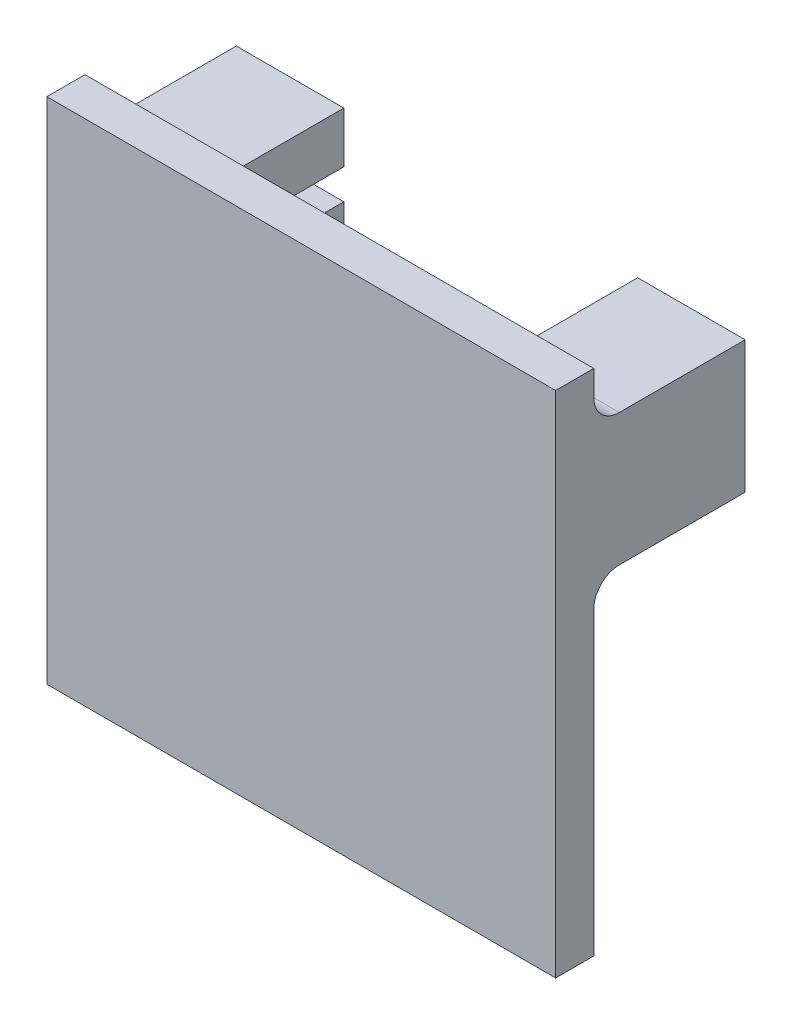
ISO-10303-21;
HEADER;
FILE_DESCRIPTION(('STEP AP214'),'2;1');
FILE_NAME('part.step','',(''),(''),'','','');
FILE_SCHEMA(('AUTOMOTIVE_DESIGN { 1 0 10303 214 1 1 1 1 }'));
ENDSEC;
DATA;
#1=APPLICATION_CONTEXT('core data for automotive mechanical design processes');
#2=APPLICATION_PROTOCOL_DEFINITION('international standard','automotive_design',2000,#1);
#3=PRODUCT_CONTEXT('',#1,'mechanical');
#4=PRODUCT('Part','Part','',(#3));
#5=PRODUCT_RELATED_PRODUCT_CATEGORY('part','',(#4));
#6=PRODUCT_DEFINITION_FORMATION('','',#4);
#7=PRODUCT_DEFINITION_CONTEXT('part definition',#1,'design');
#8=PRODUCT_DEFINITION('design','',#6,#7);
#9=PRODUCT_DEFINITION_SHAPE('','',#8);
#10=(LENGTH_UNIT() NAMED_UNIT(*) SI_UNIT(.MILLI.,.METRE.));
#11=(NAMED_UNIT(*) PLANE_ANGLE_UNIT() SI_UNIT($,.RADIAN.));
#12=(NAMED_UNIT(*) SI_UNIT($,.STERADIAN.) SOLID_ANGLE_UNIT());
#13=UNCERTAINTY_MEASURE_WITH_UNIT(LENGTH_MEASURE(1.E-05),#10,'distance_accuracy_value','');
#14=(GEOMETRIC_REPRESENTATION_CONTEXT(3) GLOBAL_UNCERTAINTY_ASSIGNED_CONTEXT((#13)) GLOBAL_UNIT_ASSIGNED_CONTEXT((#10,
#11,#12)) REPRESENTATION_CONTEXT('',''));
#15=CARTESIAN_POINT('',(0.,0.,0.));
#16=DIRECTION('',(0.,0.,1.));
#17=DIRECTION('',(1.,0.,0.));
#18=AXIS2_PLACEMENT_3D('',#15,#16,#17);
#19=CARTESIAN_POINT('',(0.,0.,0.));
#20=DIRECTION('',(0.,0.,-1.));
#21=DIRECTION('',(-1.,0.,0.));
#22=AXIS2_PLACEMENT_3D('',#19,#20,#21);
#23=PLANE('',#22);
#24=DIRECTION('',(0.,-1.,0.));
#25=VECTOR('',#24,1.);
#26=CARTESIAN_POINT('',(-11.55,21.9321987276376,0.));
#27=LINE('',#26,#25);
#28=CARTESIAN_POINT('',(-11.55,27.9321987276376,0.));
#29=VERTEX_POINT('',#28);
#30=CARTESIAN_POINT('',(-11.55,21.9321987276376,0.));
#31=VERTEX_POINT('',#30);
#32=EDGE_CURVE('E251',#29,#31,#27,.T.);
#33=ORIENTED_EDGE('',*,*,#32,.F.);
#34=DIRECTION('',(1.,0.,0.));
#35=VECTOR('',#34,1.);
#36=CARTESIAN_POINT('',(0.,27.9321987276376,0.));
#37=LINE('',#36,#35);
#38=CARTESIAN_POINT('',(-20.,27.9321987276376,0.));
#39=VERTEX_POINT('',#38);
#40=EDGE_CURVE('E423',#29,#39,#37,.F.);
#41=ORIENTED_EDGE('',*,*,#40,.T.);
#42=DIRECTION('',(0.,-1.,0.));
#43=VECTOR('',#42,1.);
#44=CARTESIAN_POINT('',(-20.,-10.0678012723624,0.));
#45=LINE('',#44,#43);
#46=CARTESIAN_POINT('',(-20.,29.9321987276376,0.));
#47=VERTEX_POINT('',#46);
#48=EDGE_CURVE('E360',#47,#39,#45,.T.);
#49=ORIENTED_EDGE('',*,*,#48,.F.);
#50=DIRECTION('',(-1.,0.,0.));
#51=VECTOR('',#50,1.);
#52=CARTESIAN_POINT('',(-20.,29.9321987276376,0.));
#53=LINE('',#52,#51);
#54=CARTESIAN_POINT('',(20.,29.9321987276376,0.));
#55=VERTEX_POINT('',#54);
#56=EDGE_CURVE('E350',#55,#47,#53,.T.);
#57=ORIENTED_EDGE('',*,*,#56,.F.);
#58=DIRECTION('',(0.,1.,0.));
#59=VECTOR('',#58,1.);
#60=CARTESIAN_POINT('',(20.,-10.0678012723624,0.));
#61=LINE('',#60,#59);
#62=CARTESIAN_POINT('',(20.,27.9321987276376,0.));
#63=VERTEX_POINT('',#62);
#64=EDGE_CURVE('E367',#63,#55,#61,.T.);
#65=ORIENTED_EDGE('',*,*,#64,.F.);
#66=DIRECTION('',(1.,0.,0.));
#67=VECTOR('',#66,1.);
#68=CARTESIAN_POINT('',(0.,27.9321987276376,0.));
#69=LINE('',#68,#67);
#70=CARTESIAN_POINT('',(11.55,27.9321987276376,0.));
#71=VERTEX_POINT('',#70);
#72=EDGE_CURVE('E230',#63,#71,#69,.F.);
#73=ORIENTED_EDGE('',*,*,#72,.T.);
#74=DIRECTION('',(0.,1.,0.));
#75=VECTOR('',#74,1.);
#76=CARTESIAN_POINT('',(11.55,21.9321987276376,0.));
#77=LINE('',#76,#75);
#78=CARTESIAN_POINT('',(11.55,21.9321987276376,0.));
#79=VERTEX_POINT('',#78);
#80=EDGE_CURVE('E218',#79,#71,#77,.T.);
#81=ORIENTED_EDGE('',*,*,#80,.F.);
#82=DIRECTION('',(-1.,0.,0.));
#83=VECTOR('',#82,1.);
#84=CARTESIAN_POINT('',(11.55,21.9321987276376,0.));
#85=LINE('',#84,#83);
#86=CARTESIAN_POINT('',(16.45,21.9321987276376,0.));
#87=VERTEX_POINT('',#86);
#88=EDGE_CURVE('E205',#87,#79,#85,.T.);
#89=ORIENTED_EDGE('',*,*,#88,.F.);
#90=DIRECTION('',(0.,1.,0.));
#91=VECTOR('',#90,1.);
#92=CARTESIAN_POINT('',(16.45,19.5521987276376,0.));
#93=LINE('',#92,#91);
#94=CARTESIAN_POINT('',(16.45,19.5521987276376,0.));
#95=VERTEX_POINT('',#94);
#96=EDGE_CURVE('E217',#95,#87,#93,.T.);
#97=ORIENTED_EDGE('',*,*,#96,.F.);
#98=DIRECTION('',(1.,0.,0.));
#99=VECTOR('',#98,1.);
#100=CARTESIAN_POINT('',(11.55,19.5521987276376,0.));
#101=LINE('',#100,#99);
#102=CARTESIAN_POINT('',(11.55,19.5521987276376,0.));
#103=VERTEX_POINT('',#102);
#104=EDGE_CURVE('E245',#103,#95,#101,.T.);
#105=ORIENTED_EDGE('',*,*,#104,.F.);
#106=DIRECTION('',(0.,1.,0.));
#107=VECTOR('',#106,1.);
#108=CARTESIAN_POINT('',(11.55,15.5521987276376,0.));
#109=LINE('',#108,#107);
#110=CARTESIAN_POINT('',(11.55,13.5521987276376,0.));
#111=VERTEX_POINT('',#110);
#112=EDGE_CURVE('E248',#111,#103,#109,.T.);
#113=ORIENTED_EDGE('',*,*,#112,.F.);
#114=DIRECTION('',(-1.,0.,0.));
#115=VECTOR('',#114,1.);
#116=CARTESIAN_POINT('',(0.,13.5521987276376,0.));
#117=LINE('',#116,#115);
#118=CARTESIAN_POINT('',(20.,13.5521987276376,0.));
#119=VERTEX_POINT('',#118);
#120=EDGE_CURVE('E393',#111,#119,#117,.F.);
#121=ORIENTED_EDGE('',*,*,#120,.T.);
#122=CARTESIAN_POINT('',(20.,-10.0678012723624,0.));
#123=VERTEX_POINT('',#122);
#124=EDGE_CURVE('E368',#123,#119,#61,.T.);
#125=ORIENTED_EDGE('',*,*,#124,.F.);
#126=DIRECTION('',(1.,0.,0.));
#127=VECTOR('',#126,1.);
#128=CARTESIAN_POINT('',(-20.,-10.0678012723624,0.));
#129=LINE('',#128,#127);
#130=CARTESIAN_POINT('',(-20.,-10.0678012723624,0.));
#131=VERTEX_POINT('',#130);
#132=EDGE_CURVE('E364',#131,#123,#129,.T.);
#133=ORIENTED_EDGE('',*,*,#132,.F.);
#134=CARTESIAN_POINT('',(-20.,13.5521987276376,0.));
#135=VERTEX_POINT('',#134);
#136=EDGE_CURVE('E345',#135,#131,#45,.T.);
#137=ORIENTED_EDGE('',*,*,#136,.F.);
#138=DIRECTION('',(-1.,0.,0.));
#139=VECTOR('',#138,1.);
#140=CARTESIAN_POINT('',(0.,13.5521987276376,0.));
#141=LINE('',#140,#139);
#142=CARTESIAN_POINT('',(-11.55,13.5521987276376,0.));
#143=VERTEX_POINT('',#142);
#144=EDGE_CURVE('E419',#135,#143,#141,.F.);
#145=ORIENTED_EDGE('',*,*,#144,.T.);
#146=DIRECTION('',(0.,-1.,0.));
#147=VECTOR('',#146,1.);
#148=CARTESIAN_POINT('',(-11.55,15.5521987276376,0.));
#149=LINE('',#148,#147);
#150=CARTESIAN_POINT('',(-11.55,19.5521987276376,0.));
#151=VERTEX_POINT('',#150);
#152=EDGE_CURVE('E276',#151,#143,#149,.T.);
#153=ORIENTED_EDGE('',*,*,#152,.F.);
#154=DIRECTION('',(1.,0.,0.));
#155=VECTOR('',#154,1.);
#156=CARTESIAN_POINT('',(-11.55,19.5521987276376,0.));
#157=LINE('',#156,#155);
#158=CARTESIAN_POINT('',(-16.45,19.5521987276376,0.));
#159=VERTEX_POINT('',#158);
#160=EDGE_CURVE('E309',#159,#151,#157,.T.);
#161=ORIENTED_EDGE('',*,*,#160,.F.);
#162=DIRECTION('',(0.,-1.,0.));
#163=VECTOR('',#162,1.);
#164=CARTESIAN_POINT('',(-16.45,19.5521987276376,0.));
#165=LINE('',#164,#163);
#166=CARTESIAN_POINT('',(-16.45,21.9321987276376,0.));
#167=VERTEX_POINT('',#166);
#168=EDGE_CURVE('E305',#167,#159,#165,.T.);
#169=ORIENTED_EDGE('',*,*,#168,.F.);
#170=DIRECTION('',(-1.,0.,0.));
#171=VECTOR('',#170,1.);
#172=CARTESIAN_POINT('',(-11.55,21.9321987276376,0.));
#173=LINE('',#172,#171);
#174=EDGE_CURVE('E301',#31,#167,#173,.T.);
#175=ORIENTED_EDGE('',*,*,#174,.F.);
#176=EDGE_LOOP('',(#33,#41,#49,#57,#65,#73,#81,#89,#97,#105,#113,#121,#125,#133,#137,#145,#153,
#161,#169,#175));
#177=FACE_BOUND('',#176,.T.);
#178=ADVANCED_FACE('F43',(#177),#23,.T.);
#179=CARTESIAN_POINT('',(-20.,-10.0678012723624,3.));
#180=DIRECTION('',(1.,0.,0.));
#181=DIRECTION('',(0.,0.,-1.));
#182=AXIS2_PLACEMENT_3D('',#179,#180,#181);
#183=PLANE('',#182);
#184=ORIENTED_EDGE('',*,*,#48,.T.);
#185=CARTESIAN_POINT('',(-20.,27.9321987276376,-2.));
#186=DIRECTION('',(1.,0.,0.));
#187=DIRECTION('',(0.,0.,-1.));
#188=AXIS2_PLACEMENT_3D('',#185,#186,#187);
#189=CIRCLE('',#188,2.);
#190=CARTESIAN_POINT('',(-20.,25.9321987276376,-2.));
#191=VERTEX_POINT('',#190);
#192=EDGE_CURVE('E433',#39,#191,#189,.T.);
#193=ORIENTED_EDGE('',*,*,#192,.T.);
#194=DIRECTION('',(0.,0.,1.));
#195=VECTOR('',#194,1.);
#196=CARTESIAN_POINT('',(-20.,25.9321987276376,-11.9));
#197=LINE('',#196,#195);
#198=CARTESIAN_POINT('',(-20.,25.9321987276376,-11.9));
#199=VERTEX_POINT('',#198);
#200=EDGE_CURVE('E341',#199,#191,#197,.T.);
#201=ORIENTED_EDGE('',*,*,#200,.F.);
#202=DIRECTION('',(0.,1.,0.));
#203=VECTOR('',#202,1.);
#204=CARTESIAN_POINT('',(-20.,15.5521987276376,-11.9));
#205=LINE('',#204,#203);
#206=CARTESIAN_POINT('',(-20.,15.5521987276376,-11.9));
#207=VERTEX_POINT('',#206);
#208=EDGE_CURVE('E271',#207,#199,#205,.T.);
#209=ORIENTED_EDGE('',*,*,#208,.F.);
#210=DIRECTION('',(0.,0.,1.));
#211=VECTOR('',#210,1.);
#212=CARTESIAN_POINT('',(-20.,15.5521987276376,-11.9));
#213=LINE('',#212,#211);
#214=CARTESIAN_POINT('',(-20.,15.5521987276376,-2.));
#215=VERTEX_POINT('',#214);
#216=EDGE_CURVE('E297',#207,#215,#213,.T.);
#217=ORIENTED_EDGE('',*,*,#216,.T.);
#218=CARTESIAN_POINT('',(-20.,13.5521987276376,-2.));
#219=DIRECTION('',(1.,0.,0.));
#220=DIRECTION('',(0.,0.,-1.));
#221=AXIS2_PLACEMENT_3D('',#218,#219,#220);
#222=CIRCLE('',#221,2.);
#223=EDGE_CURVE('E52',#215,#135,#222,.T.);
#224=ORIENTED_EDGE('',*,*,#223,.T.);
#225=ORIENTED_EDGE('',*,*,#136,.T.);
#226=DIRECTION('',(0.,0.,-1.));
#227=VECTOR('',#226,1.);
#228=CARTESIAN_POINT('',(-20.,-10.0678012723624,3.));
#229=LINE('',#228,#227);
#230=CARTESIAN_POINT('',(-20.,-10.0678012723624,3.));
#231=VERTEX_POINT('',#230);
#232=EDGE_CURVE('E385',#231,#131,#229,.T.);
#233=ORIENTED_EDGE('',*,*,#232,.F.);
#234=DIRECTION('',(0.,-1.,0.));
#235=VECTOR('',#234,1.);
#236=CARTESIAN_POINT('',(-20.,-10.0678012723624,3.));
#237=LINE('',#236,#235);
#238=CARTESIAN_POINT('',(-20.,29.9321987276376,3.));
#239=VERTEX_POINT('',#238);
#240=EDGE_CURVE('E346',#239,#231,#237,.T.);
#241=ORIENTED_EDGE('',*,*,#240,.F.);
#242=DIRECTION('',(0.,0.,-1.));
#243=VECTOR('',#242,1.);
#244=CARTESIAN_POINT('',(-20.,29.9321987276376,3.));
#245=LINE('',#244,#243);
#246=EDGE_CURVE('E359',#239,#47,#245,.T.);
#247=ORIENTED_EDGE('',*,*,#246,.T.);
#248=EDGE_LOOP('',(#184,#193,#201,#209,#217,#224,#225,#233,#241,#247));
#249=FACE_BOUND('',#248,.T.);
#250=ADVANCED_FACE('F438',(#249),#183,.F.);
#251=CARTESIAN_POINT('',(-20.,-10.0678012723624,3.));
#252=DIRECTION('',(0.,1.,0.));
#253=DIRECTION('',(0.,0.,1.));
#254=AXIS2_PLACEMENT_3D('',#251,#252,#253);
#255=PLANE('',#254);
#256=ORIENTED_EDGE('',*,*,#132,.T.);
#257=DIRECTION('',(0.,0.,-1.));
#258=VECTOR('',#257,1.);
#259=CARTESIAN_POINT('',(20.,-10.0678012723624,3.));
#260=LINE('',#259,#258);
#261=CARTESIAN_POINT('',(20.,-10.0678012723624,3.));
#262=VERTEX_POINT('',#261);
#263=EDGE_CURVE('E381',#262,#123,#260,.T.);
#264=ORIENTED_EDGE('',*,*,#263,.F.);
#265=DIRECTION('',(1.,0.,0.));
#266=VECTOR('',#265,1.);
#267=CARTESIAN_POINT('',(-20.,-10.0678012723624,3.));
#268=LINE('',#267,#266);
#269=EDGE_CURVE('E349',#231,#262,#268,.T.);
#270=ORIENTED_EDGE('',*,*,#269,.F.);
#271=ORIENTED_EDGE('',*,*,#232,.T.);
#272=EDGE_LOOP('',(#256,#264,#270,#271));
#273=FACE_BOUND('',#272,.T.);
#274=ADVANCED_FACE('F532',(#273),#255,.F.);
#275=CARTESIAN_POINT('',(20.,-10.0678012723624,3.));
#276=DIRECTION('',(-1.,0.,0.));
#277=DIRECTION('',(0.,0.,1.));
#278=AXIS2_PLACEMENT_3D('',#275,#276,#277);
#279=PLANE('',#278);
#280=DIRECTION('',(0.,0.,-1.));
#281=VECTOR('',#280,1.);
#282=CARTESIAN_POINT('',(20.,29.9321987276376,3.));
#283=LINE('',#282,#281);
#284=CARTESIAN_POINT('',(20.,29.9321987276376,3.));
#285=VERTEX_POINT('',#284);
#286=EDGE_CURVE('E377',#285,#55,#283,.T.);
#287=ORIENTED_EDGE('',*,*,#286,.F.);
#288=DIRECTION('',(0.,1.,0.));
#289=VECTOR('',#288,1.);
#290=CARTESIAN_POINT('',(20.,-10.0678012723624,3.));
#291=LINE('',#290,#289);
#292=EDGE_CURVE('E353',#262,#285,#291,.T.);
#293=ORIENTED_EDGE('',*,*,#292,.F.);
#294=ORIENTED_EDGE('',*,*,#263,.T.);
#295=ORIENTED_EDGE('',*,*,#124,.T.);
#296=CARTESIAN_POINT('',(20.,13.5521987276376,-2.));
#297=DIRECTION('',(-1.,0.,0.));
#298=DIRECTION('',(0.,0.,1.));
#299=AXIS2_PLACEMENT_3D('',#296,#297,#298);
#300=CIRCLE('',#299,2.);
#301=CARTESIAN_POINT('',(20.,15.5521987276376,-2.));
#302=VERTEX_POINT('',#301);
#303=EDGE_CURVE('E412',#119,#302,#300,.T.);
#304=ORIENTED_EDGE('',*,*,#303,.T.);
#305=DIRECTION('',(0.,0.,1.));
#306=VECTOR('',#305,1.);
#307=CARTESIAN_POINT('',(20.,15.5521987276376,-11.9));
#308=LINE('',#307,#306);
#309=CARTESIAN_POINT('',(20.,15.5521987276376,-11.9));
#310=VERTEX_POINT('',#309);
#311=EDGE_CURVE('E240',#310,#302,#308,.T.);
#312=ORIENTED_EDGE('',*,*,#311,.F.);
#313=DIRECTION('',(0.,-1.,0.));
#314=VECTOR('',#313,1.);
#315=CARTESIAN_POINT('',(20.,15.5521987276376,-11.9));
#316=LINE('',#315,#314);
#317=CARTESIAN_POINT('',(20.,25.9321987276376,-11.9));
#318=VERTEX_POINT('',#317);
#319=EDGE_CURVE('E252',#318,#310,#316,.T.);
#320=ORIENTED_EDGE('',*,*,#319,.F.);
#321=DIRECTION('',(0.,0.,1.));
#322=VECTOR('',#321,1.);
#323=CARTESIAN_POINT('',(20.,25.9321987276376,-11.9));
#324=LINE('',#323,#322);
#325=CARTESIAN_POINT('',(20.,25.9321987276376,-2.));
#326=VERTEX_POINT('',#325);
#327=EDGE_CURVE('E495',#318,#326,#324,.T.);
#328=ORIENTED_EDGE('',*,*,#327,.T.);
#329=CARTESIAN_POINT('',(20.,27.9321987276376,-2.));
#330=DIRECTION('',(-1.,0.,0.));
#331=DIRECTION('',(0.,0.,1.));
#332=AXIS2_PLACEMENT_3D('',#329,#330,#331);
#333=CIRCLE('',#332,2.);
#334=EDGE_CURVE('E402',#326,#63,#333,.T.);
#335=ORIENTED_EDGE('',*,*,#334,.T.);
#336=ORIENTED_EDGE('',*,*,#64,.T.);
#337=EDGE_LOOP('',(#287,#293,#294,#295,#304,#312,#320,#328,#335,#336));
#338=FACE_BOUND('',#337,.T.);
#339=ADVANCED_FACE('F527',(#338),#279,.F.);
#340=CARTESIAN_POINT('',(-20.,29.9321987276376,3.));
#341=DIRECTION('',(0.,-1.,0.));
#342=DIRECTION('',(0.,0.,-1.));
#343=AXIS2_PLACEMENT_3D('',#340,#341,#342);
#344=PLANE('',#343);
#345=ORIENTED_EDGE('',*,*,#56,.T.);
#346=ORIENTED_EDGE('',*,*,#246,.F.);
#347=DIRECTION('',(-1.,0.,0.));
#348=VECTOR('',#347,1.);
#349=CARTESIAN_POINT('',(-20.,29.9321987276376,3.));
#350=LINE('',#349,#348);
#351=EDGE_CURVE('E356',#285,#239,#350,.T.);
#352=ORIENTED_EDGE('',*,*,#351,.F.);
#353=ORIENTED_EDGE('',*,*,#286,.T.);
#354=EDGE_LOOP('',(#345,#346,#352,#353));
#355=FACE_BOUND('',#354,.T.);
#356=ADVANCED_FACE('F481',(#355),#344,.F.);
#357=CARTESIAN_POINT('',(0.,0.,3.));
#358=DIRECTION('',(0.,0.,-1.));
#359=DIRECTION('',(-1.,0.,0.));
#360=AXIS2_PLACEMENT_3D('',#357,#358,#359);
#361=PLANE('',#360);
#362=ORIENTED_EDGE('',*,*,#240,.T.);
#363=ORIENTED_EDGE('',*,*,#269,.T.);
#364=ORIENTED_EDGE('',*,*,#292,.T.);
#365=ORIENTED_EDGE('',*,*,#351,.T.);
#366=EDGE_LOOP('',(#362,#363,#364,#365));
#367=FACE_BOUND('',#366,.T.);
#368=ADVANCED_FACE('F534',(#367),#361,.F.);
#369=CARTESIAN_POINT('',(-20.,25.9321987276376,-11.9));
#370=DIRECTION('',(0.,-1.,0.));
#371=DIRECTION('',(1.,0.,0.));
#372=AXIS2_PLACEMENT_3D('',#369,#370,#371);
#373=PLANE('',#372);
#374=ORIENTED_EDGE('',*,*,#200,.T.);
#375=DIRECTION('',(1.,0.,0.));
#376=VECTOR('',#375,1.);
#377=CARTESIAN_POINT('',(-20.,25.9321987276376,-2.));
#378=LINE('',#377,#376);
#379=CARTESIAN_POINT('',(-11.55,25.9321987276376,-2.));
#380=VERTEX_POINT('',#379);
#381=EDGE_CURVE('E415',#191,#380,#378,.T.);
#382=ORIENTED_EDGE('',*,*,#381,.T.);
#383=DIRECTION('',(0.,0.,1.));
#384=VECTOR('',#383,1.);
#385=CARTESIAN_POINT('',(-11.55,25.9321987276376,-11.9));
#386=LINE('',#385,#384);
#387=CARTESIAN_POINT('',(-11.55,25.9321987276376,-11.9));
#388=VERTEX_POINT('',#387);
#389=EDGE_CURVE('E337',#388,#380,#386,.T.);
#390=ORIENTED_EDGE('',*,*,#389,.F.);
#391=DIRECTION('',(1.,0.,0.));
#392=VECTOR('',#391,1.);
#393=CARTESIAN_POINT('',(-20.,25.9321987276376,-11.9));
#394=LINE('',#393,#392);
#395=EDGE_CURVE('E275',#199,#388,#394,.T.);
#396=ORIENTED_EDGE('',*,*,#395,.F.);
#397=EDGE_LOOP('',(#374,#382,#390,#396));
#398=FACE_BOUND('',#397,.T.);
#399=ADVANCED_FACE('F536',(#398),#373,.F.);
#400=CARTESIAN_POINT('',(-11.55,21.9321987276376,-11.9));
#401=DIRECTION('',(-1.,0.,0.));
#402=DIRECTION('',(0.,0.,1.));
#403=AXIS2_PLACEMENT_3D('',#400,#401,#402);
#404=PLANE('',#403);
#405=ORIENTED_EDGE('',*,*,#32,.T.);
#406=DIRECTION('',(0.,0.,1.));
#407=VECTOR('',#406,1.);
#408=CARTESIAN_POINT('',(-11.55,21.9321987276376,-11.9));
#409=LINE('',#408,#407);
#410=CARTESIAN_POINT('',(-11.55,21.9321987276376,-11.9));
#411=VERTEX_POINT('',#410);
#412=EDGE_CURVE('E333',#411,#31,#409,.T.);
#413=ORIENTED_EDGE('',*,*,#412,.F.);
#414=DIRECTION('',(0.,-1.,0.));
#415=VECTOR('',#414,1.);
#416=CARTESIAN_POINT('',(-11.55,21.9321987276376,-11.9));
#417=LINE('',#416,#415);
#418=EDGE_CURVE('E279',#388,#411,#417,.T.);
#419=ORIENTED_EDGE('',*,*,#418,.F.);
#420=ORIENTED_EDGE('',*,*,#389,.T.);
#421=CARTESIAN_POINT('',(-11.55,27.9321987276376,-2.));
#422=DIRECTION('',(-1.,0.,0.));
#423=DIRECTION('',(0.,0.,1.));
#424=AXIS2_PLACEMENT_3D('',#421,#422,#423);
#425=CIRCLE('',#424,2.);
#426=EDGE_CURVE('E429',#380,#29,#425,.T.);
#427=ORIENTED_EDGE('',*,*,#426,.T.);
#428=EDGE_LOOP('',(#405,#413,#419,#420,#427));
#429=FACE_BOUND('',#428,.T.);
#430=ADVANCED_FACE('F466',(#429),#404,.F.);
#431=CARTESIAN_POINT('',(-11.55,21.9321987276376,-11.9));
#432=DIRECTION('',(0.,1.,0.));
#433=DIRECTION('',(0.,0.,1.));
#434=AXIS2_PLACEMENT_3D('',#431,#432,#433);
#435=PLANE('',#434);
#436=ORIENTED_EDGE('',*,*,#174,.T.);
#437=DIRECTION('',(0.,0.,1.));
#438=VECTOR('',#437,1.);
#439=CARTESIAN_POINT('',(-16.45,21.9321987276376,-11.9));
#440=LINE('',#439,#438);
#441=CARTESIAN_POINT('',(-16.45,21.9321987276376,-11.9));
#442=VERTEX_POINT('',#441);
#443=EDGE_CURVE('E329',#442,#167,#440,.T.);
#444=ORIENTED_EDGE('',*,*,#443,.F.);
#445=DIRECTION('',(-1.,0.,0.));
#446=VECTOR('',#445,1.);
#447=CARTESIAN_POINT('',(-11.55,21.9321987276376,-11.9));
#448=LINE('',#447,#446);
#449=EDGE_CURVE('E282',#411,#442,#448,.T.);
#450=ORIENTED_EDGE('',*,*,#449,.F.);
#451=ORIENTED_EDGE('',*,*,#412,.T.);
#452=EDGE_LOOP('',(#436,#444,#450,#451));
#453=FACE_BOUND('',#452,.T.);
#454=ADVANCED_FACE('F463',(#453),#435,.F.);
#455=CARTESIAN_POINT('',(-16.45,19.5521987276376,-11.9));
#456=DIRECTION('',(-1.,0.,0.));
#457=DIRECTION('',(0.,0.,1.));
#458=AXIS2_PLACEMENT_3D('',#455,#456,#457);
#459=PLANE('',#458);
#460=ORIENTED_EDGE('',*,*,#168,.T.);
#461=DIRECTION('',(0.,0.,1.));
#462=VECTOR('',#461,1.);
#463=CARTESIAN_POINT('',(-16.45,19.5521987276376,-11.9));
#464=LINE('',#463,#462);
#465=CARTESIAN_POINT('',(-16.45,19.5521987276376,-11.9));
#466=VERTEX_POINT('',#465);
#467=EDGE_CURVE('E325',#466,#159,#464,.T.);
#468=ORIENTED_EDGE('',*,*,#467,.F.);
#469=DIRECTION('',(0.,-1.,0.));
#470=VECTOR('',#469,1.);
#471=CARTESIAN_POINT('',(-16.45,19.5521987276376,-11.9));
#472=LINE('',#471,#470);
#473=EDGE_CURVE('E285',#442,#466,#472,.T.);
#474=ORIENTED_EDGE('',*,*,#473,.F.);
#475=ORIENTED_EDGE('',*,*,#443,.T.);
#476=EDGE_LOOP('',(#460,#468,#474,#475));
#477=FACE_BOUND('',#476,.T.);
#478=ADVANCED_FACE('F459',(#477),#459,.F.);
#479=CARTESIAN_POINT('',(-11.55,19.5521987276376,-11.9));
#480=DIRECTION('',(0.,-1.,0.));
#481=DIRECTION('',(0.,0.,-1.));
#482=AXIS2_PLACEMENT_3D('',#479,#480,#481);
#483=PLANE('',#482);
#484=ORIENTED_EDGE('',*,*,#160,.T.);
#485=DIRECTION('',(0.,0.,1.));
#486=VECTOR('',#485,1.);
#487=CARTESIAN_POINT('',(-11.55,19.5521987276376,-11.9));
#488=LINE('',#487,#486);
#489=CARTESIAN_POINT('',(-11.55,19.5521987276376,-11.9));
#490=VERTEX_POINT('',#489);
#491=EDGE_CURVE('E321',#490,#151,#488,.T.);
#492=ORIENTED_EDGE('',*,*,#491,.F.);
#493=DIRECTION('',(1.,0.,0.));
#494=VECTOR('',#493,1.);
#495=CARTESIAN_POINT('',(-11.55,19.5521987276376,-11.9));
#496=LINE('',#495,#494);
#497=EDGE_CURVE('E288',#466,#490,#496,.T.);
#498=ORIENTED_EDGE('',*,*,#497,.F.);
#499=ORIENTED_EDGE('',*,*,#467,.T.);
#500=EDGE_LOOP('',(#484,#492,#498,#499));
#501=FACE_BOUND('',#500,.T.);
#502=ADVANCED_FACE('F457',(#501),#483,.F.);
#503=CARTESIAN_POINT('',(-11.55,15.5521987276376,-11.9));
#504=DIRECTION('',(-1.,0.,0.));
#505=DIRECTION('',(0.,0.,1.));
#506=AXIS2_PLACEMENT_3D('',#503,#504,#505);
#507=PLANE('',#506);
#508=ORIENTED_EDGE('',*,*,#152,.T.);
#509=CARTESIAN_POINT('',(-11.55,13.5521987276376,-2.));
#510=DIRECTION('',(-1.,0.,0.));
#511=DIRECTION('',(0.,0.,1.));
#512=AXIS2_PLACEMENT_3D('',#509,#510,#511);
#513=CIRCLE('',#512,2.);
#514=CARTESIAN_POINT('',(-11.55,15.5521987276376,-2.));
#515=VERTEX_POINT('',#514);
#516=EDGE_CURVE('E11',#143,#515,#513,.T.);
#517=ORIENTED_EDGE('',*,*,#516,.T.);
#518=DIRECTION('',(0.,0.,1.));
#519=VECTOR('',#518,1.);
#520=CARTESIAN_POINT('',(-11.55,15.5521987276376,-11.9));
#521=LINE('',#520,#519);
#522=CARTESIAN_POINT('',(-11.55,15.5521987276376,-11.9));
#523=VERTEX_POINT('',#522);
#524=EDGE_CURVE('E318',#523,#515,#521,.T.);
#525=ORIENTED_EDGE('',*,*,#524,.F.);
#526=DIRECTION('',(0.,-1.,0.));
#527=VECTOR('',#526,1.);
#528=CARTESIAN_POINT('',(-11.55,15.5521987276376,-11.9));
#529=LINE('',#528,#527);
#530=EDGE_CURVE('E291',#490,#523,#529,.T.);
#531=ORIENTED_EDGE('',*,*,#530,.F.);
#532=ORIENTED_EDGE('',*,*,#491,.T.);
#533=EDGE_LOOP('',(#508,#517,#525,#531,#532));
#534=FACE_BOUND('',#533,.T.);
#535=ADVANCED_FACE('F449',(#534),#507,.F.);
#536=CARTESIAN_POINT('',(-20.,15.5521987276376,-11.9));
#537=DIRECTION('',(0.,1.,0.));
#538=DIRECTION('',(0.,0.,1.));
#539=AXIS2_PLACEMENT_3D('',#536,#537,#538);
#540=PLANE('',#539);
#541=ORIENTED_EDGE('',*,*,#524,.T.);
#542=DIRECTION('',(-1.,0.,0.));
#543=VECTOR('',#542,1.);
#544=CARTESIAN_POINT('',(-20.,15.5521987276376,-2.));
#545=LINE('',#544,#543);
#546=EDGE_CURVE('E426',#515,#215,#545,.T.);
#547=ORIENTED_EDGE('',*,*,#546,.T.);
#548=ORIENTED_EDGE('',*,*,#216,.F.);
#549=DIRECTION('',(-1.,0.,0.));
#550=VECTOR('',#549,1.);
#551=CARTESIAN_POINT('',(-20.,15.5521987276376,-11.9));
#552=LINE('',#551,#550);
#553=EDGE_CURVE('E294',#523,#207,#552,.T.);
#554=ORIENTED_EDGE('',*,*,#553,.F.);
#555=EDGE_LOOP('',(#541,#547,#548,#554));
#556=FACE_BOUND('',#555,.T.);
#557=ADVANCED_FACE('F446',(#556),#540,.F.);
#558=CARTESIAN_POINT('',(0.,0.,-11.9));
#559=DIRECTION('',(0.,0.,-1.));
#560=DIRECTION('',(-1.,0.,0.));
#561=AXIS2_PLACEMENT_3D('',#558,#559,#560);
#562=PLANE('',#561);
#563=ORIENTED_EDGE('',*,*,#208,.T.);
#564=ORIENTED_EDGE('',*,*,#395,.T.);
#565=ORIENTED_EDGE('',*,*,#418,.T.);
#566=ORIENTED_EDGE('',*,*,#449,.T.);
#567=ORIENTED_EDGE('',*,*,#473,.T.);
#568=ORIENTED_EDGE('',*,*,#497,.T.);
#569=ORIENTED_EDGE('',*,*,#530,.T.);
#570=ORIENTED_EDGE('',*,*,#553,.T.);
#571=EDGE_LOOP('',(#563,#564,#565,#566,#567,#568,#569,#570));
#572=FACE_BOUND('',#571,.T.);
#573=ADVANCED_FACE('F452',(#572),#562,.T.);
#574=CARTESIAN_POINT('',(20.,15.5521987276376,-11.9));
#575=DIRECTION('',(0.,1.,0.));
#576=DIRECTION('',(0.,0.,1.));
#577=AXIS2_PLACEMENT_3D('',#574,#575,#576);
#578=PLANE('',#577);
#579=ORIENTED_EDGE('',*,*,#311,.T.);
#580=DIRECTION('',(-1.,0.,0.));
#581=VECTOR('',#580,1.);
#582=CARTESIAN_POINT('',(20.,15.5521987276376,-2.));
#583=LINE('',#582,#581);
#584=CARTESIAN_POINT('',(11.55,15.5521987276376,-2.));
#585=VERTEX_POINT('',#584);
#586=EDGE_CURVE('E398',#302,#585,#583,.T.);
#587=ORIENTED_EDGE('',*,*,#586,.T.);
#588=DIRECTION('',(0.,0.,1.));
#589=VECTOR('',#588,1.);
#590=CARTESIAN_POINT('',(11.55,15.5521987276376,-11.9));
#591=LINE('',#590,#589);
#592=CARTESIAN_POINT('',(11.55,15.5521987276376,-11.9));
#593=VERTEX_POINT('',#592);
#594=EDGE_CURVE('E509',#593,#585,#591,.T.);
#595=ORIENTED_EDGE('',*,*,#594,.F.);
#596=DIRECTION('',(-1.,0.,0.));
#597=VECTOR('',#596,1.);
#598=CARTESIAN_POINT('',(20.,15.5521987276376,-11.9));
#599=LINE('',#598,#597);
#600=EDGE_CURVE('E233',#310,#593,#599,.T.);
#601=ORIENTED_EDGE('',*,*,#600,.F.);
#602=EDGE_LOOP('',(#579,#587,#595,#601));
#603=FACE_BOUND('',#602,.T.);
#604=ADVANCED_FACE('F520',(#603),#578,.F.);
#605=CARTESIAN_POINT('',(11.55,15.5521987276376,-11.9));
#606=DIRECTION('',(1.,0.,0.));
#607=DIRECTION('',(0.,0.,-1.));
#608=AXIS2_PLACEMENT_3D('',#605,#606,#607);
#609=PLANE('',#608);
#610=ORIENTED_EDGE('',*,*,#112,.T.);
#611=DIRECTION('',(0.,0.,1.));
#612=VECTOR('',#611,1.);
#613=CARTESIAN_POINT('',(11.55,19.5521987276376,-11.9));
#614=LINE('',#613,#612);
#615=CARTESIAN_POINT('',(11.55,19.5521987276376,-11.9));
#616=VERTEX_POINT('',#615);
#617=EDGE_CURVE('E505',#616,#103,#614,.T.);
#618=ORIENTED_EDGE('',*,*,#617,.F.);
#619=DIRECTION('',(0.,1.,0.));
#620=VECTOR('',#619,1.);
#621=CARTESIAN_POINT('',(11.55,15.5521987276376,-11.9));
#622=LINE('',#621,#620);
#623=EDGE_CURVE('E237',#593,#616,#622,.T.);
#624=ORIENTED_EDGE('',*,*,#623,.F.);
#625=ORIENTED_EDGE('',*,*,#594,.T.);
#626=CARTESIAN_POINT('',(11.55,13.5521987276376,-2.));
#627=DIRECTION('',(1.,0.,0.));
#628=DIRECTION('',(0.,0.,-1.));
#629=AXIS2_PLACEMENT_3D('',#626,#627,#628);
#630=CIRCLE('',#629,2.);
#631=EDGE_CURVE('E408',#585,#111,#630,.T.);
#632=ORIENTED_EDGE('',*,*,#631,.T.);
#633=EDGE_LOOP('',(#610,#618,#624,#625,#632));
#634=FACE_BOUND('',#633,.T.);
#635=ADVANCED_FACE('F514',(#634),#609,.F.);
#636=CARTESIAN_POINT('',(11.55,19.5521987276376,-11.9));
#637=DIRECTION('',(0.,-1.,0.));
#638=DIRECTION('',(0.,0.,-1.));
#639=AXIS2_PLACEMENT_3D('',#636,#637,#638);
#640=PLANE('',#639);
#641=ORIENTED_EDGE('',*,*,#104,.T.);
#642=DIRECTION('',(0.,0.,1.));
#643=VECTOR('',#642,1.);
#644=CARTESIAN_POINT('',(16.45,19.5521987276376,-11.9));
#645=LINE('',#644,#643);
#646=CARTESIAN_POINT('',(16.45,19.5521987276376,-11.9));
#647=VERTEX_POINT('',#646);
#648=EDGE_CURVE('E501',#647,#95,#645,.T.);
#649=ORIENTED_EDGE('',*,*,#648,.F.);
#650=DIRECTION('',(1.,0.,0.));
#651=VECTOR('',#650,1.);
#652=CARTESIAN_POINT('',(11.55,19.5521987276376,-11.9));
#653=LINE('',#652,#651);
#654=EDGE_CURVE('E266',#616,#647,#653,.T.);
#655=ORIENTED_EDGE('',*,*,#654,.F.);
#656=ORIENTED_EDGE('',*,*,#617,.T.);
#657=EDGE_LOOP('',(#641,#649,#655,#656));
#658=FACE_BOUND('',#657,.T.);
#659=ADVANCED_FACE('F670',(#658),#640,.F.);
#660=CARTESIAN_POINT('',(16.45,19.5521987276376,-11.9));
#661=DIRECTION('',(1.,0.,0.));
#662=DIRECTION('',(0.,0.,-1.));
#663=AXIS2_PLACEMENT_3D('',#660,#661,#662);
#664=PLANE('',#663);
#665=ORIENTED_EDGE('',*,*,#96,.T.);
#666=DIRECTION('',(0.,0.,1.));
#667=VECTOR('',#666,1.);
#668=CARTESIAN_POINT('',(16.45,21.9321987276376,-11.9));
#669=LINE('',#668,#667);
#670=CARTESIAN_POINT('',(16.45,21.9321987276376,-11.9));
#671=VERTEX_POINT('',#670);
#672=EDGE_CURVE('E212',#671,#87,#669,.T.);
#673=ORIENTED_EDGE('',*,*,#672,.F.);
#674=DIRECTION('',(0.,1.,0.));
#675=VECTOR('',#674,1.);
#676=CARTESIAN_POINT('',(16.45,19.5521987276376,-11.9));
#677=LINE('',#676,#675);
#678=EDGE_CURVE('E263',#647,#671,#677,.T.);
#679=ORIENTED_EDGE('',*,*,#678,.F.);
#680=ORIENTED_EDGE('',*,*,#648,.T.);
#681=EDGE_LOOP('',(#665,#673,#679,#680));
#682=FACE_BOUND('',#681,.T.);
#683=ADVANCED_FACE('F703',(#682),#664,.F.);
#684=CARTESIAN_POINT('',(11.55,21.9321987276376,-11.9));
#685=DIRECTION('',(0.,1.,0.));
#686=DIRECTION('',(0.,0.,1.));
#687=AXIS2_PLACEMENT_3D('',#684,#685,#686);
#688=PLANE('',#687);
#689=ORIENTED_EDGE('',*,*,#88,.T.);
#690=DIRECTION('',(0.,0.,1.));
#691=VECTOR('',#690,1.);
#692=CARTESIAN_POINT('',(11.55,21.9321987276376,-11.9));
#693=LINE('',#692,#691);
#694=CARTESIAN_POINT('',(11.55,21.9321987276376,-11.9));
#695=VERTEX_POINT('',#694);
#696=EDGE_CURVE('E209',#695,#79,#693,.T.);
#697=ORIENTED_EDGE('',*,*,#696,.F.);
#698=DIRECTION('',(-1.,0.,0.));
#699=VECTOR('',#698,1.);
#700=CARTESIAN_POINT('',(11.55,21.9321987276376,-11.9));
#701=LINE('',#700,#699);
#702=EDGE_CURVE('E260',#671,#695,#701,.T.);
#703=ORIENTED_EDGE('',*,*,#702,.F.);
#704=ORIENTED_EDGE('',*,*,#672,.T.);
#705=EDGE_LOOP('',(#689,#697,#703,#704));
#706=FACE_BOUND('',#705,.T.);
#707=ADVANCED_FACE('F207',(#706),#688,.F.);
#708=CARTESIAN_POINT('',(11.55,21.9321987276376,-11.9));
#709=DIRECTION('',(1.,0.,0.));
#710=DIRECTION('',(0.,0.,-1.));
#711=AXIS2_PLACEMENT_3D('',#708,#709,#710);
#712=PLANE('',#711);
#713=ORIENTED_EDGE('',*,*,#80,.T.);
#714=CARTESIAN_POINT('',(11.55,27.9321987276376,-2.));
#715=DIRECTION('',(1.,0.,0.));
#716=DIRECTION('',(0.,0.,-1.));
#717=AXIS2_PLACEMENT_3D('',#714,#715,#716);
#718=CIRCLE('',#717,2.);
#719=CARTESIAN_POINT('',(11.55,25.9321987276376,-2.));
#720=VERTEX_POINT('',#719);
#721=EDGE_CURVE('E405',#71,#720,#718,.T.);
#722=ORIENTED_EDGE('',*,*,#721,.T.);
#723=DIRECTION('',(0.,0.,1.));
#724=VECTOR('',#723,1.);
#725=CARTESIAN_POINT('',(11.55,25.9321987276376,-11.9));
#726=LINE('',#725,#724);
#727=CARTESIAN_POINT('',(11.55,25.9321987276376,-11.9));
#728=VERTEX_POINT('',#727);
#729=EDGE_CURVE('E226',#728,#720,#726,.T.);
#730=ORIENTED_EDGE('',*,*,#729,.F.);
#731=DIRECTION('',(0.,1.,0.));
#732=VECTOR('',#731,1.);
#733=CARTESIAN_POINT('',(11.55,21.9321987276376,-11.9));
#734=LINE('',#733,#732);
#735=EDGE_CURVE('E224',#695,#728,#734,.T.);
#736=ORIENTED_EDGE('',*,*,#735,.F.);
#737=ORIENTED_EDGE('',*,*,#696,.T.);
#738=EDGE_LOOP('',(#713,#722,#730,#736,#737));
#739=FACE_BOUND('',#738,.T.);
#740=ADVANCED_FACE('F221',(#739),#712,.F.);
#741=CARTESIAN_POINT('',(20.,25.9321987276376,-11.9));
#742=DIRECTION('',(0.,-1.,0.));
#743=DIRECTION('',(0.,0.,-1.));
#744=AXIS2_PLACEMENT_3D('',#741,#742,#743);
#745=PLANE('',#744);
#746=ORIENTED_EDGE('',*,*,#729,.T.);
#747=DIRECTION('',(1.,0.,0.));
#748=VECTOR('',#747,1.);
#749=CARTESIAN_POINT('',(20.,25.9321987276376,-2.));
#750=LINE('',#749,#748);
#751=EDGE_CURVE('E389',#720,#326,#750,.T.);
#752=ORIENTED_EDGE('',*,*,#751,.T.);
#753=ORIENTED_EDGE('',*,*,#327,.F.);
#754=DIRECTION('',(1.,0.,0.));
#755=VECTOR('',#754,1.);
#756=CARTESIAN_POINT('',(20.,25.9321987276376,-11.9));
#757=LINE('',#756,#755);
#758=EDGE_CURVE('E255',#728,#318,#757,.T.);
#759=ORIENTED_EDGE('',*,*,#758,.F.);
#760=EDGE_LOOP('',(#746,#752,#753,#759));
#761=FACE_BOUND('',#760,.T.);
#762=ADVANCED_FACE('F491',(#761),#745,.F.);
#763=CARTESIAN_POINT('',(0.,0.,-11.9));
#764=DIRECTION('',(0.,0.,-1.));
#765=DIRECTION('',(-1.,0.,0.));
#766=AXIS2_PLACEMENT_3D('',#763,#764,#765);
#767=PLANE('',#766);
#768=ORIENTED_EDGE('',*,*,#600,.T.);
#769=ORIENTED_EDGE('',*,*,#623,.T.);
#770=ORIENTED_EDGE('',*,*,#654,.T.);
#771=ORIENTED_EDGE('',*,*,#678,.T.);
#772=ORIENTED_EDGE('',*,*,#702,.T.);
#773=ORIENTED_EDGE('',*,*,#735,.T.);
#774=ORIENTED_EDGE('',*,*,#758,.T.);
#775=ORIENTED_EDGE('',*,*,#319,.T.);
#776=EDGE_LOOP('',(#768,#769,#770,#771,#772,#773,#774,#775));
#777=FACE_BOUND('',#776,.T.);
#778=ADVANCED_FACE('F558',(#777),#767,.T.);
#779=CARTESIAN_POINT('',(20.,27.9321987276376,-2.));
#780=DIRECTION('',(1.,0.,0.));
#781=DIRECTION('',(0.,0.,-1.));
#782=AXIS2_PLACEMENT_3D('',#779,#780,#781);
#783=CYLINDRICAL_SURFACE('',#782,2.);
#784=ORIENTED_EDGE('',*,*,#721,.F.);
#785=ORIENTED_EDGE('',*,*,#72,.F.);
#786=ORIENTED_EDGE('',*,*,#334,.F.);
#787=ORIENTED_EDGE('',*,*,#751,.F.);
#788=EDGE_LOOP('',(#784,#785,#786,#787));
#789=FACE_BOUND('',#788,.T.);
#790=ADVANCED_FACE('F486',(#789),#783,.F.);
#791=CARTESIAN_POINT('',(20.,13.5521987276376,-2.));
#792=DIRECTION('',(-1.,0.,0.));
#793=DIRECTION('',(0.,0.,1.));
#794=AXIS2_PLACEMENT_3D('',#791,#792,#793);
#795=CYLINDRICAL_SURFACE('',#794,2.);
#796=ORIENTED_EDGE('',*,*,#303,.F.);
#797=ORIENTED_EDGE('',*,*,#120,.F.);
#798=ORIENTED_EDGE('',*,*,#631,.F.);
#799=ORIENTED_EDGE('',*,*,#586,.F.);
#800=EDGE_LOOP('',(#796,#797,#798,#799));
#801=FACE_BOUND('',#800,.T.);
#802=ADVANCED_FACE('F525',(#801),#795,.F.);
#803=CARTESIAN_POINT('',(-20.,27.9321987276376,-2.));
#804=DIRECTION('',(1.,0.,0.));
#805=DIRECTION('',(0.,1.,0.));
#806=AXIS2_PLACEMENT_3D('',#803,#804,#805);
#807=CYLINDRICAL_SURFACE('',#806,2.);
#808=ORIENTED_EDGE('',*,*,#192,.F.);
#809=ORIENTED_EDGE('',*,*,#40,.F.);
#810=ORIENTED_EDGE('',*,*,#426,.F.);
#811=ORIENTED_EDGE('',*,*,#381,.F.);
#812=EDGE_LOOP('',(#808,#809,#810,#811));
#813=FACE_BOUND('',#812,.T.);
#814=ADVANCED_FACE('F473',(#813),#807,.F.);
#815=CARTESIAN_POINT('',(-20.,13.5521987276376,-2.));
#816=DIRECTION('',(-1.,0.,0.));
#817=DIRECTION('',(0.,0.,1.));
#818=AXIS2_PLACEMENT_3D('',#815,#816,#817);
#819=CYLINDRICAL_SURFACE('',#818,2.);
#820=ORIENTED_EDGE('',*,*,#516,.F.);
#821=ORIENTED_EDGE('',*,*,#144,.F.);
#822=ORIENTED_EDGE('',*,*,#223,.F.);
#823=ORIENTED_EDGE('',*,*,#546,.F.);
#824=EDGE_LOOP('',(#820,#821,#822,#823));
#825=FACE_BOUND('',#824,.T.);
#826=ADVANCED_FACE('F45',(#825),#819,.F.);
#827=CLOSED_SHELL('',(#178,#250,#274,#339,#356,#368,#399,#430,#454,#478,#502,#535,#557,#573,
#604,#635,#659,#683,#707,#740,#762,#778,#790,#802,#814,#826));
#828=MANIFOLD_SOLID_BREP('B2',#827);
#829=ADVANCED_BREP_SHAPE_REPRESENTATION('',(#18,#828),#14);
#830=SHAPE_DEFINITION_REPRESENTATION(#9,#829);
ENDSEC;
END-ISO-10303-21;
